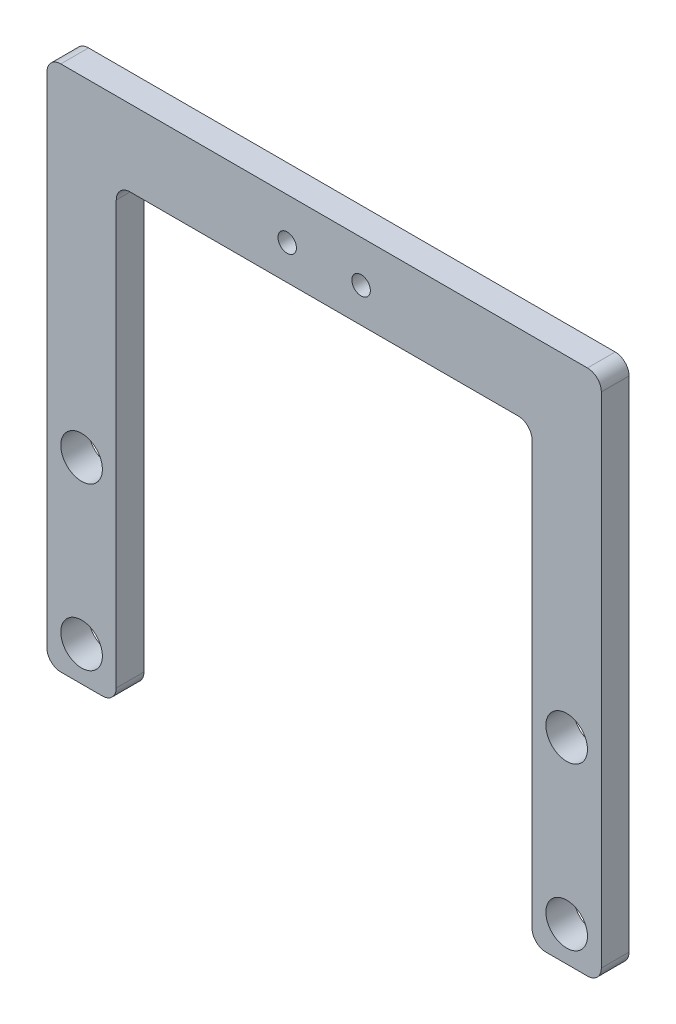
ISO-10303-21;
HEADER;
FILE_DESCRIPTION(('STEP AP214'),'2;1');
FILE_NAME('part.step','',(''),(''),'','','');
FILE_SCHEMA(('AUTOMOTIVE_DESIGN { 1 0 10303 214 1 1 1 1 }'));
ENDSEC;
DATA;
#1=APPLICATION_CONTEXT('core data for automotive mechanical design processes');
#2=APPLICATION_PROTOCOL_DEFINITION('international standard','automotive_design',2000,#1);
#3=PRODUCT_CONTEXT('',#1,'mechanical');
#4=PRODUCT('Part','Part','',(#3));
#5=PRODUCT_RELATED_PRODUCT_CATEGORY('part','',(#4));
#6=PRODUCT_DEFINITION_FORMATION('','',#4);
#7=PRODUCT_DEFINITION_CONTEXT('part definition',#1,'design');
#8=PRODUCT_DEFINITION('design','',#6,#7);
#9=PRODUCT_DEFINITION_SHAPE('','',#8);
#10=(LENGTH_UNIT() NAMED_UNIT(*) SI_UNIT(.MILLI.,.METRE.));
#11=(NAMED_UNIT(*) PLANE_ANGLE_UNIT() SI_UNIT($,.RADIAN.));
#12=(NAMED_UNIT(*) SI_UNIT($,.STERADIAN.) SOLID_ANGLE_UNIT());
#13=UNCERTAINTY_MEASURE_WITH_UNIT(LENGTH_MEASURE(1.E-05),#10,'distance_accuracy_value','');
#14=(GEOMETRIC_REPRESENTATION_CONTEXT(3) GLOBAL_UNCERTAINTY_ASSIGNED_CONTEXT((#13)) GLOBAL_UNIT_ASSIGNED_CONTEXT((#10,
#11,#12)) REPRESENTATION_CONTEXT('',''));
#15=CARTESIAN_POINT('',(0.,0.,0.));
#16=DIRECTION('',(0.,0.,1.));
#17=DIRECTION('',(1.,0.,0.));
#18=AXIS2_PLACEMENT_3D('',#15,#16,#17);
#19=CARTESIAN_POINT('',(57.,-39.5,6.));
#20=DIRECTION('',(0.,0.,-1.));
#21=DIRECTION('',(-1.,0.,0.));
#22=AXIS2_PLACEMENT_3D('',#19,#20,#21);
#23=PLANE('',#22);
#24=DIRECTION('',(0.,-1.,0.));
#25=VECTOR('',#24,1.);
#26=CARTESIAN_POINT('',(60.,68.5,6.));
#27=LINE('',#26,#25);
#28=CARTESIAN_POINT('',(60.,68.5,6.));
#29=VERTEX_POINT('',#28);
#30=CARTESIAN_POINT('',(60.,-39.5,6.));
#31=VERTEX_POINT('',#30);
#32=EDGE_CURVE('E529',#29,#31,#27,.T.);
#33=ORIENTED_EDGE('',*,*,#32,.F.);
#34=CARTESIAN_POINT('',(57.,68.5,6.));
#35=DIRECTION('',(0.,0.,1.));
#36=DIRECTION('',(1.,0.,0.));
#37=AXIS2_PLACEMENT_3D('',#34,#35,#36);
#38=CIRCLE('',#37,3.);
#39=CARTESIAN_POINT('',(57.,71.5,6.));
#40=VERTEX_POINT('',#39);
#41=EDGE_CURVE('E480',#29,#40,#38,.T.);
#42=ORIENTED_EDGE('',*,*,#41,.T.);
#43=DIRECTION('',(1.,0.,0.));
#44=VECTOR('',#43,1.);
#45=CARTESIAN_POINT('',(-57.,71.5,6.));
#46=LINE('',#45,#44);
#47=CARTESIAN_POINT('',(-57.,71.5,6.));
#48=VERTEX_POINT('',#47);
#49=EDGE_CURVE('E462',#48,#40,#46,.T.);
#50=ORIENTED_EDGE('',*,*,#49,.F.);
#51=CARTESIAN_POINT('',(-57.,68.5,6.));
#52=DIRECTION('',(0.,0.,1.));
#53=DIRECTION('',(1.,0.,0.));
#54=AXIS2_PLACEMENT_3D('',#51,#52,#53);
#55=CIRCLE('',#54,3.);
#56=CARTESIAN_POINT('',(-60.,68.5,6.));
#57=VERTEX_POINT('',#56);
#58=EDGE_CURVE('E471',#48,#57,#55,.T.);
#59=ORIENTED_EDGE('',*,*,#58,.T.);
#60=DIRECTION('',(0.,1.,0.));
#61=VECTOR('',#60,1.);
#62=CARTESIAN_POINT('',(-60.,-39.5,6.));
#63=LINE('',#62,#61);
#64=CARTESIAN_POINT('',(-60.,-39.5,6.));
#65=VERTEX_POINT('',#64);
#66=EDGE_CURVE('E476',#65,#57,#63,.T.);
#67=ORIENTED_EDGE('',*,*,#66,.F.);
#68=CARTESIAN_POINT('',(-57.,-39.5,6.));
#69=DIRECTION('',(0.,0.,-1.));
#70=DIRECTION('',(-1.,0.,0.));
#71=AXIS2_PLACEMENT_3D('',#68,#69,#70);
#72=CIRCLE('',#71,3.);
#73=CARTESIAN_POINT('',(-57.,-42.5,6.));
#74=VERTEX_POINT('',#73);
#75=EDGE_CURVE('E590',#74,#65,#72,.T.);
#76=ORIENTED_EDGE('',*,*,#75,.F.);
#77=DIRECTION('',(1.,0.,0.));
#78=VECTOR('',#77,1.);
#79=CARTESIAN_POINT('',(-57.,-42.5,6.));
#80=LINE('',#79,#78);
#81=CARTESIAN_POINT('',(-48.,-42.5,6.));
#82=VERTEX_POINT('',#81);
#83=EDGE_CURVE('E588',#74,#82,#80,.T.);
#84=ORIENTED_EDGE('',*,*,#83,.T.);
#85=CARTESIAN_POINT('',(-48.,-39.5,6.));
#86=DIRECTION('',(0.,0.,-1.));
#87=DIRECTION('',(-1.,0.,0.));
#88=AXIS2_PLACEMENT_3D('',#85,#86,#87);
#89=CIRCLE('',#88,3.);
#90=CARTESIAN_POINT('',(-45.,-39.5,6.));
#91=VERTEX_POINT('',#90);
#92=EDGE_CURVE('E585',#91,#82,#89,.T.);
#93=ORIENTED_EDGE('',*,*,#92,.F.);
#94=DIRECTION('',(0.,1.,0.));
#95=VECTOR('',#94,1.);
#96=CARTESIAN_POINT('',(-45.,-39.5,6.));
#97=LINE('',#96,#95);
#98=CARTESIAN_POINT('',(-45.,52.,6.));
#99=VERTEX_POINT('',#98);
#100=EDGE_CURVE('E583',#91,#99,#97,.T.);
#101=ORIENTED_EDGE('',*,*,#100,.T.);
#102=CARTESIAN_POINT('',(-42.,52.,6.));
#103=DIRECTION('',(0.,0.,1.));
#104=DIRECTION('',(1.,0.,0.));
#105=AXIS2_PLACEMENT_3D('',#102,#103,#104);
#106=CIRCLE('',#105,3.);
#107=CARTESIAN_POINT('',(-42.,55.,6.));
#108=VERTEX_POINT('',#107);
#109=EDGE_CURVE('E580',#108,#99,#106,.T.);
#110=ORIENTED_EDGE('',*,*,#109,.F.);
#111=DIRECTION('',(1.,0.,0.));
#112=VECTOR('',#111,1.);
#113=CARTESIAN_POINT('',(-42.,55.,6.));
#114=LINE('',#113,#112);
#115=CARTESIAN_POINT('',(42.,55.,6.));
#116=VERTEX_POINT('',#115);
#117=EDGE_CURVE('E578',#108,#116,#114,.T.);
#118=ORIENTED_EDGE('',*,*,#117,.T.);
#119=CARTESIAN_POINT('',(42.,52.,6.));
#120=DIRECTION('',(0.,0.,1.));
#121=DIRECTION('',(1.,0.,0.));
#122=AXIS2_PLACEMENT_3D('',#119,#120,#121);
#123=CIRCLE('',#122,3.);
#124=CARTESIAN_POINT('',(45.,52.,6.));
#125=VERTEX_POINT('',#124);
#126=EDGE_CURVE('E575',#125,#116,#123,.T.);
#127=ORIENTED_EDGE('',*,*,#126,.F.);
#128=DIRECTION('',(0.,1.,0.));
#129=VECTOR('',#128,1.);
#130=CARTESIAN_POINT('',(45.,-39.5,6.));
#131=LINE('',#130,#129);
#132=CARTESIAN_POINT('',(45.,-39.5,6.));
#133=VERTEX_POINT('',#132);
#134=EDGE_CURVE('E572',#133,#125,#131,.T.);
#135=ORIENTED_EDGE('',*,*,#134,.F.);
#136=CARTESIAN_POINT('',(48.,-39.5,6.));
#137=DIRECTION('',(0.,0.,-1.));
#138=DIRECTION('',(-1.,0.,0.));
#139=AXIS2_PLACEMENT_3D('',#136,#137,#138);
#140=CIRCLE('',#139,3.);
#141=CARTESIAN_POINT('',(48.,-42.5,6.));
#142=VERTEX_POINT('',#141);
#143=EDGE_CURVE('E569',#142,#133,#140,.T.);
#144=ORIENTED_EDGE('',*,*,#143,.F.);
#145=DIRECTION('',(1.,0.,0.));
#146=VECTOR('',#145,1.);
#147=CARTESIAN_POINT('',(48.,-42.5,6.));
#148=LINE('',#147,#146);
#149=CARTESIAN_POINT('',(57.,-42.5,6.));
#150=VERTEX_POINT('',#149);
#151=EDGE_CURVE('E562',#142,#150,#148,.T.);
#152=ORIENTED_EDGE('',*,*,#151,.T.);
#153=CARTESIAN_POINT('',(57.,-39.5,6.));
#154=DIRECTION('',(0.,0.,-1.));
#155=DIRECTION('',(-1.,0.,0.));
#156=AXIS2_PLACEMENT_3D('',#153,#154,#155);
#157=CIRCLE('',#156,3.);
#158=EDGE_CURVE('E560',#31,#150,#157,.T.);
#159=ORIENTED_EDGE('',*,*,#158,.F.);
#160=EDGE_LOOP('',(#33,#42,#50,#59,#67,#76,#84,#93,#101,#110,#118,#127,#135,#144,#152,#159));
#161=FACE_BOUND('',#160,.T.);
#162=CARTESIAN_POINT('',(-8.00000000000001,62.5,6.));
#163=DIRECTION('',(0.,0.,1.));
#164=DIRECTION('',(1.,0.,0.));
#165=AXIS2_PLACEMENT_3D('',#162,#163,#164);
#166=CIRCLE('',#165,2.);
#167=CARTESIAN_POINT('',(-6.00000000000001,62.5,6.));
#168=VERTEX_POINT('',#167);
#169=EDGE_CURVE('E489',#168,#168,#166,.T.);
#170=ORIENTED_EDGE('',*,*,#169,.F.);
#171=EDGE_LOOP('',(#170));
#172=FACE_BOUND('',#171,.T.);
#173=CARTESIAN_POINT('',(7.99999999999999,62.5,6.));
#174=DIRECTION('',(0.,0.,1.));
#175=DIRECTION('',(1.,0.,0.));
#176=AXIS2_PLACEMENT_3D('',#173,#174,#175);
#177=CIRCLE('',#176,2.);
#178=CARTESIAN_POINT('',(9.99999999999999,62.5,6.));
#179=VERTEX_POINT('',#178);
#180=EDGE_CURVE('E787',#179,#179,#177,.T.);
#181=ORIENTED_EDGE('',*,*,#180,.F.);
#182=EDGE_LOOP('',(#181));
#183=FACE_BOUND('',#182,.T.);
#184=CARTESIAN_POINT('',(-52.5,0.,6.));
#185=DIRECTION('',(0.,0.,1.));
#186=DIRECTION('',(1.,0.,0.));
#187=AXIS2_PLACEMENT_3D('',#184,#185,#186);
#188=CIRCLE('',#187,4.5);
#189=CARTESIAN_POINT('',(-48.,0.,6.));
#190=VERTEX_POINT('',#189);
#191=EDGE_CURVE('E781',#190,#190,#188,.T.);
#192=ORIENTED_EDGE('',*,*,#191,.F.);
#193=EDGE_LOOP('',(#192));
#194=FACE_BOUND('',#193,.T.);
#195=CARTESIAN_POINT('',(-52.5,-35.,6.));
#196=DIRECTION('',(0.,0.,1.));
#197=DIRECTION('',(1.,0.,0.));
#198=AXIS2_PLACEMENT_3D('',#195,#196,#197);
#199=CIRCLE('',#198,4.5);
#200=CARTESIAN_POINT('',(-48.,-35.,6.));
#201=VERTEX_POINT('',#200);
#202=EDGE_CURVE('E775',#201,#201,#199,.T.);
#203=ORIENTED_EDGE('',*,*,#202,.F.);
#204=EDGE_LOOP('',(#203));
#205=FACE_BOUND('',#204,.T.);
#206=CARTESIAN_POINT('',(52.5,0.,6.));
#207=DIRECTION('',(0.,0.,1.));
#208=DIRECTION('',(1.,0.,0.));
#209=AXIS2_PLACEMENT_3D('',#206,#207,#208);
#210=CIRCLE('',#209,4.5);
#211=CARTESIAN_POINT('',(57.,0.,6.));
#212=VERTEX_POINT('',#211);
#213=EDGE_CURVE('E769',#212,#212,#210,.T.);
#214=ORIENTED_EDGE('',*,*,#213,.F.);
#215=EDGE_LOOP('',(#214));
#216=FACE_BOUND('',#215,.T.);
#217=CARTESIAN_POINT('',(52.5,-35.,6.));
#218=DIRECTION('',(0.,0.,1.));
#219=DIRECTION('',(1.,0.,0.));
#220=AXIS2_PLACEMENT_3D('',#217,#218,#219);
#221=CIRCLE('',#220,4.5);
#222=CARTESIAN_POINT('',(57.,-35.,6.));
#223=VERTEX_POINT('',#222);
#224=EDGE_CURVE('E760',#223,#223,#221,.T.);
#225=ORIENTED_EDGE('',*,*,#224,.F.);
#226=EDGE_LOOP('',(#225));
#227=FACE_BOUND('',#226,.T.);
#228=ADVANCED_FACE('F340',(#161,#172,#183,#194,#205,#216,#227),#23,.F.);
#229=CARTESIAN_POINT('',(57.,-39.5,0.));
#230=DIRECTION('',(0.,0.,-1.));
#231=DIRECTION('',(-1.,0.,0.));
#232=AXIS2_PLACEMENT_3D('',#229,#230,#231);
#233=PLANE('',#232);
#234=CARTESIAN_POINT('',(52.5,0.,0.));
#235=DIRECTION('',(0.,0.,1.));
#236=DIRECTION('',(1.,0.,0.));
#237=AXIS2_PLACEMENT_3D('',#234,#235,#236);
#238=CIRCLE('',#237,4.5);
#239=CARTESIAN_POINT('',(57.,0.,0.));
#240=VERTEX_POINT('',#239);
#241=EDGE_CURVE('E766',#240,#240,#238,.T.);
#242=ORIENTED_EDGE('',*,*,#241,.T.);
#243=EDGE_LOOP('',(#242));
#244=FACE_BOUND('',#243,.T.);
#245=CARTESIAN_POINT('',(-52.5,0.,0.));
#246=DIRECTION('',(0.,0.,1.));
#247=DIRECTION('',(1.,0.,0.));
#248=AXIS2_PLACEMENT_3D('',#245,#246,#247);
#249=CIRCLE('',#248,4.5);
#250=CARTESIAN_POINT('',(-48.,0.,0.));
#251=VERTEX_POINT('',#250);
#252=EDGE_CURVE('E778',#251,#251,#249,.T.);
#253=ORIENTED_EDGE('',*,*,#252,.T.);
#254=EDGE_LOOP('',(#253));
#255=FACE_BOUND('',#254,.T.);
#256=CARTESIAN_POINT('',(-8.00000000000001,62.5,0.));
#257=DIRECTION('',(0.,0.,1.));
#258=DIRECTION('',(1.,0.,0.));
#259=AXIS2_PLACEMENT_3D('',#256,#257,#258);
#260=CIRCLE('',#259,2.);
#261=CARTESIAN_POINT('',(-6.00000000000001,62.5,0.));
#262=VERTEX_POINT('',#261);
#263=EDGE_CURVE('E565',#262,#262,#260,.T.);
#264=ORIENTED_EDGE('',*,*,#263,.T.);
#265=EDGE_LOOP('',(#264));
#266=FACE_BOUND('',#265,.T.);
#267=DIRECTION('',(0.,-1.,0.));
#268=VECTOR('',#267,1.);
#269=CARTESIAN_POINT('',(60.,68.5,0.));
#270=LINE('',#269,#268);
#271=CARTESIAN_POINT('',(60.,68.5,0.));
#272=VERTEX_POINT('',#271);
#273=CARTESIAN_POINT('',(60.,-39.5,0.));
#274=VERTEX_POINT('',#273);
#275=EDGE_CURVE('E485',#272,#274,#270,.T.);
#276=ORIENTED_EDGE('',*,*,#275,.T.);
#277=CARTESIAN_POINT('',(57.,-39.5,0.));
#278=DIRECTION('',(0.,0.,-1.));
#279=DIRECTION('',(-1.,0.,0.));
#280=AXIS2_PLACEMENT_3D('',#277,#278,#279);
#281=CIRCLE('',#280,3.);
#282=CARTESIAN_POINT('',(57.,-42.5,0.));
#283=VERTEX_POINT('',#282);
#284=EDGE_CURVE('E488',#274,#283,#281,.T.);
#285=ORIENTED_EDGE('',*,*,#284,.T.);
#286=DIRECTION('',(1.,0.,0.));
#287=VECTOR('',#286,1.);
#288=CARTESIAN_POINT('',(48.,-42.5,0.));
#289=LINE('',#288,#287);
#290=CARTESIAN_POINT('',(48.,-42.5,0.));
#291=VERTEX_POINT('',#290);
#292=EDGE_CURVE('E492',#291,#283,#289,.T.);
#293=ORIENTED_EDGE('',*,*,#292,.F.);
#294=CARTESIAN_POINT('',(48.,-39.5,0.));
#295=DIRECTION('',(0.,0.,-1.));
#296=DIRECTION('',(-1.,0.,0.));
#297=AXIS2_PLACEMENT_3D('',#294,#295,#296);
#298=CIRCLE('',#297,3.);
#299=CARTESIAN_POINT('',(45.,-39.5,0.));
#300=VERTEX_POINT('',#299);
#301=EDGE_CURVE('E495',#291,#300,#298,.T.);
#302=ORIENTED_EDGE('',*,*,#301,.T.);
#303=DIRECTION('',(0.,1.,0.));
#304=VECTOR('',#303,1.);
#305=CARTESIAN_POINT('',(45.,-39.5,0.));
#306=LINE('',#305,#304);
#307=CARTESIAN_POINT('',(45.,52.,0.));
#308=VERTEX_POINT('',#307);
#309=EDGE_CURVE('E498',#300,#308,#306,.T.);
#310=ORIENTED_EDGE('',*,*,#309,.T.);
#311=CARTESIAN_POINT('',(42.,52.,0.));
#312=DIRECTION('',(0.,0.,1.));
#313=DIRECTION('',(1.,0.,0.));
#314=AXIS2_PLACEMENT_3D('',#311,#312,#313);
#315=CIRCLE('',#314,3.);
#316=CARTESIAN_POINT('',(42.,55.,0.));
#317=VERTEX_POINT('',#316);
#318=EDGE_CURVE('E501',#308,#317,#315,.T.);
#319=ORIENTED_EDGE('',*,*,#318,.T.);
#320=DIRECTION('',(1.,0.,0.));
#321=VECTOR('',#320,1.);
#322=CARTESIAN_POINT('',(-42.,55.,0.));
#323=LINE('',#322,#321);
#324=CARTESIAN_POINT('',(-42.,55.,0.));
#325=VERTEX_POINT('',#324);
#326=EDGE_CURVE('E504',#325,#317,#323,.T.);
#327=ORIENTED_EDGE('',*,*,#326,.F.);
#328=CARTESIAN_POINT('',(-42.,52.,0.));
#329=DIRECTION('',(0.,0.,1.));
#330=DIRECTION('',(1.,0.,0.));
#331=AXIS2_PLACEMENT_3D('',#328,#329,#330);
#332=CIRCLE('',#331,3.);
#333=CARTESIAN_POINT('',(-45.,52.,0.));
#334=VERTEX_POINT('',#333);
#335=EDGE_CURVE('E507',#325,#334,#332,.T.);
#336=ORIENTED_EDGE('',*,*,#335,.T.);
#337=DIRECTION('',(0.,1.,0.));
#338=VECTOR('',#337,1.);
#339=CARTESIAN_POINT('',(-45.,-39.5,0.));
#340=LINE('',#339,#338);
#341=CARTESIAN_POINT('',(-45.,-39.5,0.));
#342=VERTEX_POINT('',#341);
#343=EDGE_CURVE('E510',#342,#334,#340,.T.);
#344=ORIENTED_EDGE('',*,*,#343,.F.);
#345=CARTESIAN_POINT('',(-48.,-39.5,0.));
#346=DIRECTION('',(0.,0.,-1.));
#347=DIRECTION('',(-1.,0.,0.));
#348=AXIS2_PLACEMENT_3D('',#345,#346,#347);
#349=CIRCLE('',#348,3.);
#350=CARTESIAN_POINT('',(-48.,-42.5,0.));
#351=VERTEX_POINT('',#350);
#352=EDGE_CURVE('E513',#342,#351,#349,.T.);
#353=ORIENTED_EDGE('',*,*,#352,.T.);
#354=DIRECTION('',(1.,0.,0.));
#355=VECTOR('',#354,1.);
#356=CARTESIAN_POINT('',(-57.,-42.5,0.));
#357=LINE('',#356,#355);
#358=CARTESIAN_POINT('',(-57.,-42.5,0.));
#359=VERTEX_POINT('',#358);
#360=EDGE_CURVE('E516',#359,#351,#357,.T.);
#361=ORIENTED_EDGE('',*,*,#360,.F.);
#362=CARTESIAN_POINT('',(-57.,-39.5,0.));
#363=DIRECTION('',(0.,0.,-1.));
#364=DIRECTION('',(-1.,0.,0.));
#365=AXIS2_PLACEMENT_3D('',#362,#363,#364);
#366=CIRCLE('',#365,3.);
#367=CARTESIAN_POINT('',(-60.,-39.5,0.));
#368=VERTEX_POINT('',#367);
#369=EDGE_CURVE('E519',#359,#368,#366,.T.);
#370=ORIENTED_EDGE('',*,*,#369,.T.);
#371=DIRECTION('',(0.,1.,0.));
#372=VECTOR('',#371,1.);
#373=CARTESIAN_POINT('',(-60.,-39.5,0.));
#374=LINE('',#373,#372);
#375=CARTESIAN_POINT('',(-60.,68.5,0.));
#376=VERTEX_POINT('',#375);
#377=EDGE_CURVE('E522',#368,#376,#374,.T.);
#378=ORIENTED_EDGE('',*,*,#377,.T.);
#379=CARTESIAN_POINT('',(-57.,68.5,0.));
#380=DIRECTION('',(0.,0.,1.));
#381=DIRECTION('',(1.,0.,0.));
#382=AXIS2_PLACEMENT_3D('',#379,#380,#381);
#383=CIRCLE('',#382,3.);
#384=CARTESIAN_POINT('',(-57.,71.5,0.));
#385=VERTEX_POINT('',#384);
#386=EDGE_CURVE('E525',#385,#376,#383,.T.);
#387=ORIENTED_EDGE('',*,*,#386,.F.);
#388=DIRECTION('',(1.,0.,0.));
#389=VECTOR('',#388,1.);
#390=CARTESIAN_POINT('',(-57.,71.5,0.));
#391=LINE('',#390,#389);
#392=CARTESIAN_POINT('',(57.,71.5,0.));
#393=VERTEX_POINT('',#392);
#394=EDGE_CURVE('E464',#385,#393,#391,.T.);
#395=ORIENTED_EDGE('',*,*,#394,.T.);
#396=CARTESIAN_POINT('',(57.,68.5,0.));
#397=DIRECTION('',(0.,0.,1.));
#398=DIRECTION('',(1.,0.,0.));
#399=AXIS2_PLACEMENT_3D('',#396,#397,#398);
#400=CIRCLE('',#399,3.);
#401=EDGE_CURVE('E528',#272,#393,#400,.T.);
#402=ORIENTED_EDGE('',*,*,#401,.F.);
#403=EDGE_LOOP('',(#276,#285,#293,#302,#310,#319,#327,#336,#344,#353,#361,#370,#378,#387,#395,#402));
#404=FACE_BOUND('',#403,.T.);
#405=CARTESIAN_POINT('',(7.99999999999999,62.5,0.));
#406=DIRECTION('',(0.,0.,1.));
#407=DIRECTION('',(1.,0.,0.));
#408=AXIS2_PLACEMENT_3D('',#405,#406,#407);
#409=CIRCLE('',#408,2.);
#410=CARTESIAN_POINT('',(9.99999999999999,62.5,0.));
#411=VERTEX_POINT('',#410);
#412=EDGE_CURVE('E784',#411,#411,#409,.T.);
#413=ORIENTED_EDGE('',*,*,#412,.T.);
#414=EDGE_LOOP('',(#413));
#415=FACE_BOUND('',#414,.T.);
#416=CARTESIAN_POINT('',(-52.5,-35.,0.));
#417=DIRECTION('',(0.,0.,1.));
#418=DIRECTION('',(1.,0.,0.));
#419=AXIS2_PLACEMENT_3D('',#416,#417,#418);
#420=CIRCLE('',#419,4.5);
#421=CARTESIAN_POINT('',(-48.,-35.,0.));
#422=VERTEX_POINT('',#421);
#423=EDGE_CURVE('E772',#422,#422,#420,.T.);
#424=ORIENTED_EDGE('',*,*,#423,.T.);
#425=EDGE_LOOP('',(#424));
#426=FACE_BOUND('',#425,.T.);
#427=CARTESIAN_POINT('',(52.5,-35.,0.));
#428=DIRECTION('',(0.,0.,1.));
#429=DIRECTION('',(1.,0.,0.));
#430=AXIS2_PLACEMENT_3D('',#427,#428,#429);
#431=CIRCLE('',#430,4.5);
#432=CARTESIAN_POINT('',(57.,-35.,0.));
#433=VERTEX_POINT('',#432);
#434=EDGE_CURVE('E763',#433,#433,#431,.T.);
#435=ORIENTED_EDGE('',*,*,#434,.T.);
#436=EDGE_LOOP('',(#435));
#437=FACE_BOUND('',#436,.T.);
#438=ADVANCED_FACE('F557',(#244,#255,#266,#404,#415,#426,#437),#233,.T.);
#439=CARTESIAN_POINT('',(60.,68.5,6.));
#440=DIRECTION('',(1.,0.,0.));
#441=DIRECTION('',(0.,1.,0.));
#442=AXIS2_PLACEMENT_3D('',#439,#440,#441);
#443=PLANE('',#442);
#444=ORIENTED_EDGE('',*,*,#275,.F.);
#445=DIRECTION('',(0.,0.,-1.));
#446=VECTOR('',#445,1.);
#447=CARTESIAN_POINT('',(60.,68.5,6.));
#448=LINE('',#447,#446);
#449=EDGE_CURVE('E12',#29,#272,#448,.T.);
#450=ORIENTED_EDGE('',*,*,#449,.F.);
#451=ORIENTED_EDGE('',*,*,#32,.T.);
#452=DIRECTION('',(0.,0.,-1.));
#453=VECTOR('',#452,1.);
#454=CARTESIAN_POINT('',(60.,-39.5,6.));
#455=LINE('',#454,#453);
#456=EDGE_CURVE('E344',#31,#274,#455,.T.);
#457=ORIENTED_EDGE('',*,*,#456,.T.);
#458=EDGE_LOOP('',(#444,#450,#451,#457));
#459=FACE_BOUND('',#458,.T.);
#460=ADVANCED_FACE('F342',(#459),#443,.T.);
#461=CARTESIAN_POINT('',(57.,68.5,6.));
#462=DIRECTION('',(0.,0.,-1.));
#463=DIRECTION('',(-1.,0.,0.));
#464=AXIS2_PLACEMENT_3D('',#461,#462,#463);
#465=CYLINDRICAL_SURFACE('',#464,3.);
#466=ORIENTED_EDGE('',*,*,#401,.T.);
#467=DIRECTION('',(0.,0.,-1.));
#468=VECTOR('',#467,1.);
#469=CARTESIAN_POINT('',(57.,71.5,6.));
#470=LINE('',#469,#468);
#471=EDGE_CURVE('E350',#40,#393,#470,.T.);
#472=ORIENTED_EDGE('',*,*,#471,.F.);
#473=ORIENTED_EDGE('',*,*,#41,.F.);
#474=ORIENTED_EDGE('',*,*,#449,.T.);
#475=EDGE_LOOP('',(#466,#472,#473,#474));
#476=FACE_BOUND('',#475,.T.);
#477=ADVANCED_FACE('F559',(#476),#465,.T.);
#478=CARTESIAN_POINT('',(-57.,71.5,6.));
#479=DIRECTION('',(0.,1.,0.));
#480=DIRECTION('',(0.,0.,1.));
#481=AXIS2_PLACEMENT_3D('',#478,#479,#480);
#482=PLANE('',#481);
#483=ORIENTED_EDGE('',*,*,#394,.F.);
#484=DIRECTION('',(0.,0.,-1.));
#485=VECTOR('',#484,1.);
#486=CARTESIAN_POINT('',(-57.,71.5,6.));
#487=LINE('',#486,#485);
#488=EDGE_CURVE('E458',#48,#385,#487,.T.);
#489=ORIENTED_EDGE('',*,*,#488,.F.);
#490=ORIENTED_EDGE('',*,*,#49,.T.);
#491=ORIENTED_EDGE('',*,*,#471,.T.);
#492=EDGE_LOOP('',(#483,#489,#490,#491));
#493=FACE_BOUND('',#492,.T.);
#494=ADVANCED_FACE('F460',(#493),#482,.T.);
#495=CARTESIAN_POINT('',(-57.,68.5,6.));
#496=DIRECTION('',(0.,0.,-1.));
#497=DIRECTION('',(-1.,0.,0.));
#498=AXIS2_PLACEMENT_3D('',#495,#496,#497);
#499=CYLINDRICAL_SURFACE('',#498,3.);
#500=ORIENTED_EDGE('',*,*,#386,.T.);
#501=DIRECTION('',(0.,0.,-1.));
#502=VECTOR('',#501,1.);
#503=CARTESIAN_POINT('',(-60.,68.5,6.));
#504=LINE('',#503,#502);
#505=EDGE_CURVE('E468',#57,#376,#504,.T.);
#506=ORIENTED_EDGE('',*,*,#505,.F.);
#507=ORIENTED_EDGE('',*,*,#58,.F.);
#508=ORIENTED_EDGE('',*,*,#488,.T.);
#509=EDGE_LOOP('',(#500,#506,#507,#508));
#510=FACE_BOUND('',#509,.T.);
#511=ADVANCED_FACE('F472',(#510),#499,.T.);
#512=CARTESIAN_POINT('',(-60.,-39.5,6.));
#513=DIRECTION('',(-1.,0.,0.));
#514=DIRECTION('',(0.,0.,1.));
#515=AXIS2_PLACEMENT_3D('',#512,#513,#514);
#516=PLANE('',#515);
#517=ORIENTED_EDGE('',*,*,#377,.F.);
#518=DIRECTION('',(0.,0.,-1.));
#519=VECTOR('',#518,1.);
#520=CARTESIAN_POINT('',(-60.,-39.5,6.));
#521=LINE('',#520,#519);
#522=EDGE_CURVE('E533',#65,#368,#521,.T.);
#523=ORIENTED_EDGE('',*,*,#522,.F.);
#524=ORIENTED_EDGE('',*,*,#66,.T.);
#525=ORIENTED_EDGE('',*,*,#505,.T.);
#526=EDGE_LOOP('',(#517,#523,#524,#525));
#527=FACE_BOUND('',#526,.T.);
#528=ADVANCED_FACE('F594',(#527),#516,.T.);
#529=CARTESIAN_POINT('',(-57.,-39.5,6.));
#530=DIRECTION('',(0.,0.,-1.));
#531=DIRECTION('',(-1.,0.,0.));
#532=AXIS2_PLACEMENT_3D('',#529,#530,#531);
#533=CYLINDRICAL_SURFACE('',#532,3.);
#534=ORIENTED_EDGE('',*,*,#369,.F.);
#535=DIRECTION('',(0.,0.,-1.));
#536=VECTOR('',#535,1.);
#537=CARTESIAN_POINT('',(-57.,-42.5,6.));
#538=LINE('',#537,#536);
#539=EDGE_CURVE('E535',#74,#359,#538,.T.);
#540=ORIENTED_EDGE('',*,*,#539,.F.);
#541=ORIENTED_EDGE('',*,*,#75,.T.);
#542=ORIENTED_EDGE('',*,*,#522,.T.);
#543=EDGE_LOOP('',(#534,#540,#541,#542));
#544=FACE_BOUND('',#543,.T.);
#545=ADVANCED_FACE('F598',(#544),#533,.T.);
#546=CARTESIAN_POINT('',(-57.,-42.5,6.));
#547=DIRECTION('',(0.,1.,0.));
#548=DIRECTION('',(0.,0.,1.));
#549=AXIS2_PLACEMENT_3D('',#546,#547,#548);
#550=PLANE('',#549);
#551=ORIENTED_EDGE('',*,*,#360,.T.);
#552=DIRECTION('',(0.,0.,-1.));
#553=VECTOR('',#552,1.);
#554=CARTESIAN_POINT('',(-48.,-42.5,6.));
#555=LINE('',#554,#553);
#556=EDGE_CURVE('E537',#82,#351,#555,.T.);
#557=ORIENTED_EDGE('',*,*,#556,.F.);
#558=ORIENTED_EDGE('',*,*,#83,.F.);
#559=ORIENTED_EDGE('',*,*,#539,.T.);
#560=EDGE_LOOP('',(#551,#557,#558,#559));
#561=FACE_BOUND('',#560,.T.);
#562=ADVANCED_FACE('F603',(#561),#550,.F.);
#563=CARTESIAN_POINT('',(-48.,-39.5,6.));
#564=DIRECTION('',(0.,0.,-1.));
#565=DIRECTION('',(-1.,0.,0.));
#566=AXIS2_PLACEMENT_3D('',#563,#564,#565);
#567=CYLINDRICAL_SURFACE('',#566,3.);
#568=ORIENTED_EDGE('',*,*,#352,.F.);
#569=DIRECTION('',(0.,0.,-1.));
#570=VECTOR('',#569,1.);
#571=CARTESIAN_POINT('',(-45.,-39.5,6.));
#572=LINE('',#571,#570);
#573=EDGE_CURVE('E539',#91,#342,#572,.T.);
#574=ORIENTED_EDGE('',*,*,#573,.F.);
#575=ORIENTED_EDGE('',*,*,#92,.T.);
#576=ORIENTED_EDGE('',*,*,#556,.T.);
#577=EDGE_LOOP('',(#568,#574,#575,#576));
#578=FACE_BOUND('',#577,.T.);
#579=ADVANCED_FACE('F610',(#578),#567,.T.);
#580=CARTESIAN_POINT('',(-45.,-39.5,6.));
#581=DIRECTION('',(-1.,0.,0.));
#582=DIRECTION('',(0.,0.,1.));
#583=AXIS2_PLACEMENT_3D('',#580,#581,#582);
#584=PLANE('',#583);
#585=ORIENTED_EDGE('',*,*,#343,.T.);
#586=DIRECTION('',(0.,0.,-1.));
#587=VECTOR('',#586,1.);
#588=CARTESIAN_POINT('',(-45.,52.,6.));
#589=LINE('',#588,#587);
#590=EDGE_CURVE('E541',#99,#334,#589,.T.);
#591=ORIENTED_EDGE('',*,*,#590,.F.);
#592=ORIENTED_EDGE('',*,*,#100,.F.);
#593=ORIENTED_EDGE('',*,*,#573,.T.);
#594=EDGE_LOOP('',(#585,#591,#592,#593));
#595=FACE_BOUND('',#594,.T.);
#596=ADVANCED_FACE('F613',(#595),#584,.F.);
#597=CARTESIAN_POINT('',(-42.,52.,6.));
#598=DIRECTION('',(0.,0.,-1.));
#599=DIRECTION('',(-1.,0.,0.));
#600=AXIS2_PLACEMENT_3D('',#597,#598,#599);
#601=CYLINDRICAL_SURFACE('',#600,3.);
#602=ORIENTED_EDGE('',*,*,#335,.F.);
#603=DIRECTION('',(0.,0.,-1.));
#604=VECTOR('',#603,1.);
#605=CARTESIAN_POINT('',(-42.,55.,6.));
#606=LINE('',#605,#604);
#607=EDGE_CURVE('E543',#108,#325,#606,.T.);
#608=ORIENTED_EDGE('',*,*,#607,.F.);
#609=ORIENTED_EDGE('',*,*,#109,.T.);
#610=ORIENTED_EDGE('',*,*,#590,.T.);
#611=EDGE_LOOP('',(#602,#608,#609,#610));
#612=FACE_BOUND('',#611,.T.);
#613=ADVANCED_FACE('F616',(#612),#601,.F.);
#614=CARTESIAN_POINT('',(-42.,55.,6.));
#615=DIRECTION('',(0.,1.,0.));
#616=DIRECTION('',(0.,0.,1.));
#617=AXIS2_PLACEMENT_3D('',#614,#615,#616);
#618=PLANE('',#617);
#619=ORIENTED_EDGE('',*,*,#326,.T.);
#620=DIRECTION('',(0.,0.,-1.));
#621=VECTOR('',#620,1.);
#622=CARTESIAN_POINT('',(42.,55.,6.));
#623=LINE('',#622,#621);
#624=EDGE_CURVE('E545',#116,#317,#623,.T.);
#625=ORIENTED_EDGE('',*,*,#624,.F.);
#626=ORIENTED_EDGE('',*,*,#117,.F.);
#627=ORIENTED_EDGE('',*,*,#607,.T.);
#628=EDGE_LOOP('',(#619,#625,#626,#627));
#629=FACE_BOUND('',#628,.T.);
#630=ADVANCED_FACE('F622',(#629),#618,.F.);
#631=CARTESIAN_POINT('',(42.,52.,6.));
#632=DIRECTION('',(0.,0.,-1.));
#633=DIRECTION('',(-1.,0.,0.));
#634=AXIS2_PLACEMENT_3D('',#631,#632,#633);
#635=CYLINDRICAL_SURFACE('',#634,3.);
#636=ORIENTED_EDGE('',*,*,#318,.F.);
#637=DIRECTION('',(0.,0.,-1.));
#638=VECTOR('',#637,1.);
#639=CARTESIAN_POINT('',(45.,52.,6.));
#640=LINE('',#639,#638);
#641=EDGE_CURVE('E547',#125,#308,#640,.T.);
#642=ORIENTED_EDGE('',*,*,#641,.F.);
#643=ORIENTED_EDGE('',*,*,#126,.T.);
#644=ORIENTED_EDGE('',*,*,#624,.T.);
#645=EDGE_LOOP('',(#636,#642,#643,#644));
#646=FACE_BOUND('',#645,.T.);
#647=ADVANCED_FACE('F626',(#646),#635,.F.);
#648=CARTESIAN_POINT('',(45.,-39.5,6.));
#649=DIRECTION('',(-1.,0.,0.));
#650=DIRECTION('',(0.,0.,1.));
#651=AXIS2_PLACEMENT_3D('',#648,#649,#650);
#652=PLANE('',#651);
#653=ORIENTED_EDGE('',*,*,#309,.F.);
#654=DIRECTION('',(0.,0.,-1.));
#655=VECTOR('',#654,1.);
#656=CARTESIAN_POINT('',(45.,-39.5,6.));
#657=LINE('',#656,#655);
#658=EDGE_CURVE('E549',#133,#300,#657,.T.);
#659=ORIENTED_EDGE('',*,*,#658,.F.);
#660=ORIENTED_EDGE('',*,*,#134,.T.);
#661=ORIENTED_EDGE('',*,*,#641,.T.);
#662=EDGE_LOOP('',(#653,#659,#660,#661));
#663=FACE_BOUND('',#662,.T.);
#664=ADVANCED_FACE('F629',(#663),#652,.T.);
#665=CARTESIAN_POINT('',(48.,-39.5,6.));
#666=DIRECTION('',(0.,0.,-1.));
#667=DIRECTION('',(-1.,0.,0.));
#668=AXIS2_PLACEMENT_3D('',#665,#666,#667);
#669=CYLINDRICAL_SURFACE('',#668,3.);
#670=ORIENTED_EDGE('',*,*,#301,.F.);
#671=DIRECTION('',(0.,0.,-1.));
#672=VECTOR('',#671,1.);
#673=CARTESIAN_POINT('',(48.,-42.5,6.));
#674=LINE('',#673,#672);
#675=EDGE_CURVE('E551',#142,#291,#674,.T.);
#676=ORIENTED_EDGE('',*,*,#675,.F.);
#677=ORIENTED_EDGE('',*,*,#143,.T.);
#678=ORIENTED_EDGE('',*,*,#658,.T.);
#679=EDGE_LOOP('',(#670,#676,#677,#678));
#680=FACE_BOUND('',#679,.T.);
#681=ADVANCED_FACE('F633',(#680),#669,.T.);
#682=CARTESIAN_POINT('',(48.,-42.5,6.));
#683=DIRECTION('',(0.,1.,0.));
#684=DIRECTION('',(0.,0.,1.));
#685=AXIS2_PLACEMENT_3D('',#682,#683,#684);
#686=PLANE('',#685);
#687=ORIENTED_EDGE('',*,*,#292,.T.);
#688=DIRECTION('',(0.,0.,-1.));
#689=VECTOR('',#688,1.);
#690=CARTESIAN_POINT('',(57.,-42.5,6.));
#691=LINE('',#690,#689);
#692=EDGE_CURVE('E552',#150,#283,#691,.T.);
#693=ORIENTED_EDGE('',*,*,#692,.F.);
#694=ORIENTED_EDGE('',*,*,#151,.F.);
#695=ORIENTED_EDGE('',*,*,#675,.T.);
#696=EDGE_LOOP('',(#687,#693,#694,#695));
#697=FACE_BOUND('',#696,.T.);
#698=ADVANCED_FACE('F636',(#697),#686,.F.);
#699=CARTESIAN_POINT('',(57.,-39.5,6.));
#700=DIRECTION('',(0.,0.,-1.));
#701=DIRECTION('',(-1.,0.,0.));
#702=AXIS2_PLACEMENT_3D('',#699,#700,#701);
#703=CYLINDRICAL_SURFACE('',#702,3.);
#704=ORIENTED_EDGE('',*,*,#284,.F.);
#705=ORIENTED_EDGE('',*,*,#456,.F.);
#706=ORIENTED_EDGE('',*,*,#158,.T.);
#707=ORIENTED_EDGE('',*,*,#692,.T.);
#708=EDGE_LOOP('',(#704,#705,#706,#707));
#709=FACE_BOUND('',#708,.T.);
#710=ADVANCED_FACE('F554',(#709),#703,.T.);
#711=CARTESIAN_POINT('',(-8.00000000000001,62.5,6.));
#712=DIRECTION('',(0.,0.,-1.));
#713=DIRECTION('',(-1.,0.,0.));
#714=AXIS2_PLACEMENT_3D('',#711,#712,#713);
#715=CYLINDRICAL_SURFACE('',#714,2.);
#716=ORIENTED_EDGE('',*,*,#169,.T.);
#717=EDGE_LOOP('',(#716));
#718=FACE_BOUND('',#717,.T.);
#719=ORIENTED_EDGE('',*,*,#263,.F.);
#720=EDGE_LOOP('',(#719));
#721=FACE_BOUND('',#720,.T.);
#722=ADVANCED_FACE('F643',(#718,#721),#715,.F.);
#723=CARTESIAN_POINT('',(7.99999999999999,62.5,6.));
#724=DIRECTION('',(0.,0.,-1.));
#725=DIRECTION('',(-1.,0.,0.));
#726=AXIS2_PLACEMENT_3D('',#723,#724,#725);
#727=CYLINDRICAL_SURFACE('',#726,2.);
#728=ORIENTED_EDGE('',*,*,#180,.T.);
#729=EDGE_LOOP('',(#728));
#730=FACE_BOUND('',#729,.T.);
#731=ORIENTED_EDGE('',*,*,#412,.F.);
#732=EDGE_LOOP('',(#731));
#733=FACE_BOUND('',#732,.T.);
#734=ADVANCED_FACE('F705',(#730,#733),#727,.F.);
#735=CARTESIAN_POINT('',(-52.5,0.,6.));
#736=DIRECTION('',(0.,0.,-1.));
#737=DIRECTION('',(-1.,0.,0.));
#738=AXIS2_PLACEMENT_3D('',#735,#736,#737);
#739=CYLINDRICAL_SURFACE('',#738,4.5);
#740=ORIENTED_EDGE('',*,*,#191,.T.);
#741=EDGE_LOOP('',(#740));
#742=FACE_BOUND('',#741,.T.);
#743=ORIENTED_EDGE('',*,*,#252,.F.);
#744=EDGE_LOOP('',(#743));
#745=FACE_BOUND('',#744,.T.);
#746=ADVANCED_FACE('F714',(#742,#745),#739,.F.);
#747=CARTESIAN_POINT('',(-52.5,-35.,6.));
#748=DIRECTION('',(0.,0.,-1.));
#749=DIRECTION('',(-1.,0.,0.));
#750=AXIS2_PLACEMENT_3D('',#747,#748,#749);
#751=CYLINDRICAL_SURFACE('',#750,4.5);
#752=ORIENTED_EDGE('',*,*,#202,.T.);
#753=EDGE_LOOP('',(#752));
#754=FACE_BOUND('',#753,.T.);
#755=ORIENTED_EDGE('',*,*,#423,.F.);
#756=EDGE_LOOP('',(#755));
#757=FACE_BOUND('',#756,.T.);
#758=ADVANCED_FACE('F723',(#754,#757),#751,.F.);
#759=CARTESIAN_POINT('',(52.5,0.,6.));
#760=DIRECTION('',(0.,0.,-1.));
#761=DIRECTION('',(-1.,0.,0.));
#762=AXIS2_PLACEMENT_3D('',#759,#760,#761);
#763=CYLINDRICAL_SURFACE('',#762,4.5);
#764=ORIENTED_EDGE('',*,*,#213,.T.);
#765=EDGE_LOOP('',(#764));
#766=FACE_BOUND('',#765,.T.);
#767=ORIENTED_EDGE('',*,*,#241,.F.);
#768=EDGE_LOOP('',(#767));
#769=FACE_BOUND('',#768,.T.);
#770=ADVANCED_FACE('F733',(#766,#769),#763,.F.);
#771=CARTESIAN_POINT('',(52.5,-35.,6.));
#772=DIRECTION('',(0.,0.,-1.));
#773=DIRECTION('',(-1.,0.,0.));
#774=AXIS2_PLACEMENT_3D('',#771,#772,#773);
#775=CYLINDRICAL_SURFACE('',#774,4.5);
#776=ORIENTED_EDGE('',*,*,#224,.T.);
#777=EDGE_LOOP('',(#776));
#778=FACE_BOUND('',#777,.T.);
#779=ORIENTED_EDGE('',*,*,#434,.F.);
#780=EDGE_LOOP('',(#779));
#781=FACE_BOUND('',#780,.T.);
#782=ADVANCED_FACE('F743',(#778,#781),#775,.F.);
#783=CLOSED_SHELL('',(#228,#438,#460,#477,#494,#511,#528,#545,#562,#579,#596,#613,#630,#647,
#664,#681,#698,#710,#722,#734,#746,#758,#770,#782));
#784=MANIFOLD_SOLID_BREP('B2',#783);
#785=ADVANCED_BREP_SHAPE_REPRESENTATION('',(#18,#784),#14);
#786=SHAPE_DEFINITION_REPRESENTATION(#9,#785);
ENDSEC;
END-ISO-10303-21;
